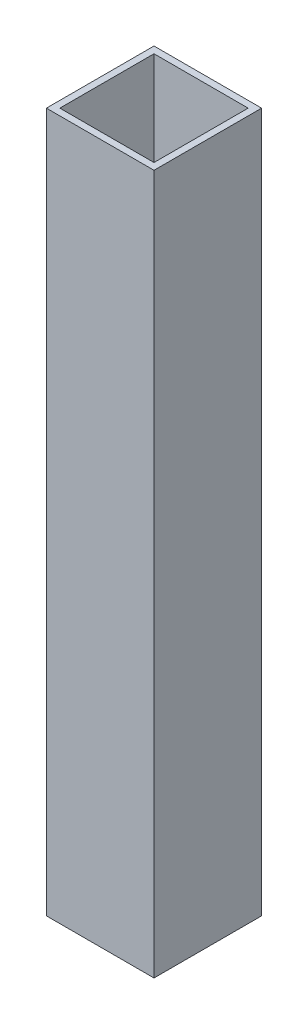
ISO-10303-21;
HEADER;
FILE_DESCRIPTION(('STEP AP214'),'2;1');
FILE_NAME('part.step','',(''),(''),'','','');
FILE_SCHEMA(('AUTOMOTIVE_DESIGN { 1 0 10303 214 1 1 1 1 }'));
ENDSEC;
DATA;
#1=APPLICATION_CONTEXT('core data for automotive mechanical design processes');
#2=APPLICATION_PROTOCOL_DEFINITION('international standard','automotive_design',2000,#1);
#3=PRODUCT_CONTEXT('',#1,'mechanical');
#4=PRODUCT('Part','Part','',(#3));
#5=PRODUCT_RELATED_PRODUCT_CATEGORY('part','',(#4));
#6=PRODUCT_DEFINITION_FORMATION('','',#4);
#7=PRODUCT_DEFINITION_CONTEXT('part definition',#1,'design');
#8=PRODUCT_DEFINITION('design','',#6,#7);
#9=PRODUCT_DEFINITION_SHAPE('','',#8);
#10=(LENGTH_UNIT() NAMED_UNIT(*) SI_UNIT(.MILLI.,.METRE.));
#11=(NAMED_UNIT(*) PLANE_ANGLE_UNIT() SI_UNIT($,.RADIAN.));
#12=(NAMED_UNIT(*) SI_UNIT($,.STERADIAN.) SOLID_ANGLE_UNIT());
#13=UNCERTAINTY_MEASURE_WITH_UNIT(LENGTH_MEASURE(1.E-05),#10,'distance_accuracy_value','');
#14=(GEOMETRIC_REPRESENTATION_CONTEXT(3) GLOBAL_UNCERTAINTY_ASSIGNED_CONTEXT((#13)) GLOBAL_UNIT_ASSIGNED_CONTEXT((#10,
#11,#12)) REPRESENTATION_CONTEXT('',''));
#15=CARTESIAN_POINT('',(0.,0.,0.));
#16=DIRECTION('',(0.,0.,1.));
#17=DIRECTION('',(1.,0.,0.));
#18=AXIS2_PLACEMENT_3D('',#15,#16,#17);
#19=CARTESIAN_POINT('',(821.935699023182,165.1,152.4));
#20=DIRECTION('',(1.,0.,0.));
#21=DIRECTION('',(0.,0.,-1.));
#22=AXIS2_PLACEMENT_3D('',#19,#20,#21);
#23=PLANE('',#22);
#24=DIRECTION('',(0.,0.,1.));
#25=VECTOR('',#24,1.);
#26=CARTESIAN_POINT('',(821.935699023182,-165.1,152.4));
#27=LINE('',#26,#25);
#28=CARTESIAN_POINT('',(821.935699023182,-165.1,130.175));
#29=VERTEX_POINT('',#28);
#30=CARTESIAN_POINT('',(821.935699023182,-165.1,174.625));
#31=VERTEX_POINT('',#30);
#32=EDGE_CURVE('E157',#29,#31,#27,.T.);
#33=ORIENTED_EDGE('',*,*,#32,.T.);
#34=DIRECTION('',(0.,-1.,0.));
#35=VECTOR('',#34,1.);
#36=CARTESIAN_POINT('',(821.935699023182,165.1,174.625));
#37=LINE('',#36,#35);
#38=CARTESIAN_POINT('',(821.935699023182,165.1,174.625));
#39=VERTEX_POINT('',#38);
#40=EDGE_CURVE('E9',#39,#31,#37,.T.);
#41=ORIENTED_EDGE('',*,*,#40,.F.);
#42=DIRECTION('',(0.,0.,1.));
#43=VECTOR('',#42,1.);
#44=CARTESIAN_POINT('',(821.935699023182,165.1,152.4));
#45=LINE('',#44,#43);
#46=CARTESIAN_POINT('',(821.935699023182,165.1,130.175));
#47=VERTEX_POINT('',#46);
#48=EDGE_CURVE('E117',#47,#39,#45,.T.);
#49=ORIENTED_EDGE('',*,*,#48,.F.);
#50=DIRECTION('',(0.,-1.,0.));
#51=VECTOR('',#50,1.);
#52=CARTESIAN_POINT('',(821.935699023182,165.1,130.175));
#53=LINE('',#52,#51);
#54=EDGE_CURVE('E39',#47,#29,#53,.T.);
#55=ORIENTED_EDGE('',*,*,#54,.T.);
#56=EDGE_LOOP('',(#33,#41,#49,#55));
#57=FACE_BOUND('',#56,.T.);
#58=ADVANCED_FACE('F14',(#57),#23,.F.);
#59=CARTESIAN_POINT('',(822.268575429916,165.1,174.625));
#60=DIRECTION('',(0.,0.,1.));
#61=DIRECTION('',(1.,0.,0.));
#62=AXIS2_PLACEMENT_3D('',#59,#60,#61);
#63=PLANE('',#62);
#64=DIRECTION('',(-1.,0.,0.));
#65=VECTOR('',#64,1.);
#66=CARTESIAN_POINT('',(822.268575429916,-165.1,174.625));
#67=LINE('',#66,#65);
#68=CARTESIAN_POINT('',(777.485699023182,-165.1,174.625));
#69=VERTEX_POINT('',#68);
#70=EDGE_CURVE('E124',#31,#69,#67,.T.);
#71=ORIENTED_EDGE('',*,*,#70,.T.);
#72=DIRECTION('',(0.,-1.,0.));
#73=VECTOR('',#72,1.);
#74=CARTESIAN_POINT('',(777.485699023182,165.1,174.625));
#75=LINE('',#74,#73);
#76=CARTESIAN_POINT('',(777.485699023182,165.1,174.625));
#77=VERTEX_POINT('',#76);
#78=EDGE_CURVE('E25',#77,#69,#75,.T.);
#79=ORIENTED_EDGE('',*,*,#78,.F.);
#80=DIRECTION('',(-1.,0.,0.));
#81=VECTOR('',#80,1.);
#82=CARTESIAN_POINT('',(822.268575429916,165.1,174.625));
#83=LINE('',#82,#81);
#84=EDGE_CURVE('E111',#39,#77,#83,.T.);
#85=ORIENTED_EDGE('',*,*,#84,.F.);
#86=ORIENTED_EDGE('',*,*,#40,.T.);
#87=EDGE_LOOP('',(#71,#79,#85,#86));
#88=FACE_BOUND('',#87,.T.);
#89=ADVANCED_FACE('F123',(#88),#63,.F.);
#90=CARTESIAN_POINT('',(777.485699023182,165.1,152.4));
#91=DIRECTION('',(1.,0.,0.));
#92=DIRECTION('',(0.,0.,-1.));
#93=AXIS2_PLACEMENT_3D('',#90,#91,#92);
#94=PLANE('',#93);
#95=DIRECTION('',(0.,0.,1.));
#96=VECTOR('',#95,1.);
#97=CARTESIAN_POINT('',(777.485699023182,-165.1,152.4));
#98=LINE('',#97,#96);
#99=CARTESIAN_POINT('',(777.485699023182,-165.1,130.175));
#100=VERTEX_POINT('',#99);
#101=EDGE_CURVE('E161',#100,#69,#98,.T.);
#102=ORIENTED_EDGE('',*,*,#101,.F.);
#103=DIRECTION('',(0.,-1.,0.));
#104=VECTOR('',#103,1.);
#105=CARTESIAN_POINT('',(777.485699023182,165.1,130.175));
#106=LINE('',#105,#104);
#107=CARTESIAN_POINT('',(777.485699023182,165.1,130.175));
#108=VERTEX_POINT('',#107);
#109=EDGE_CURVE('E74',#108,#100,#106,.T.);
#110=ORIENTED_EDGE('',*,*,#109,.F.);
#111=DIRECTION('',(0.,0.,1.));
#112=VECTOR('',#111,1.);
#113=CARTESIAN_POINT('',(777.485699023182,165.1,152.4));
#114=LINE('',#113,#112);
#115=EDGE_CURVE('E116',#108,#77,#114,.T.);
#116=ORIENTED_EDGE('',*,*,#115,.T.);
#117=ORIENTED_EDGE('',*,*,#78,.T.);
#118=EDGE_LOOP('',(#102,#110,#116,#117));
#119=FACE_BOUND('',#118,.T.);
#120=ADVANCED_FACE('F129',(#119),#94,.T.);
#121=CARTESIAN_POINT('',(661.181740408425,165.1,127.));
#122=DIRECTION('',(0.,0.,-1.));
#123=DIRECTION('',(-1.,0.,0.));
#124=AXIS2_PLACEMENT_3D('',#121,#122,#123);
#125=PLANE('',#124);
#126=DIRECTION('',(1.,0.,0.));
#127=VECTOR('',#126,1.);
#128=CARTESIAN_POINT('',(661.181740408425,-165.1,127.));
#129=LINE('',#128,#127);
#130=CARTESIAN_POINT('',(774.310699023182,-165.1,127.));
#131=VERTEX_POINT('',#130);
#132=CARTESIAN_POINT('',(825.110699023182,-165.1,127.));
#133=VERTEX_POINT('',#132);
#134=EDGE_CURVE('E141',#131,#133,#129,.T.);
#135=ORIENTED_EDGE('',*,*,#134,.F.);
#136=DIRECTION('',(0.,-1.,0.));
#137=VECTOR('',#136,1.);
#138=CARTESIAN_POINT('',(774.310699023182,165.1,127.));
#139=LINE('',#138,#137);
#140=CARTESIAN_POINT('',(774.310699023182,165.1,127.));
#141=VERTEX_POINT('',#140);
#142=EDGE_CURVE('E18',#141,#131,#139,.T.);
#143=ORIENTED_EDGE('',*,*,#142,.F.);
#144=DIRECTION('',(1.,0.,0.));
#145=VECTOR('',#144,1.);
#146=CARTESIAN_POINT('',(661.181740408425,165.1,127.));
#147=LINE('',#146,#145);
#148=CARTESIAN_POINT('',(825.110699023182,165.1,127.));
#149=VERTEX_POINT('',#148);
#150=EDGE_CURVE('E167',#141,#149,#147,.T.);
#151=ORIENTED_EDGE('',*,*,#150,.T.);
#152=DIRECTION('',(0.,-1.,0.));
#153=VECTOR('',#152,1.);
#154=CARTESIAN_POINT('',(825.110699023182,165.1,127.));
#155=LINE('',#154,#153);
#156=EDGE_CURVE('E137',#149,#133,#155,.T.);
#157=ORIENTED_EDGE('',*,*,#156,.T.);
#158=EDGE_LOOP('',(#135,#143,#151,#157));
#159=FACE_BOUND('',#158,.T.);
#160=ADVANCED_FACE('F16',(#159),#125,.T.);
#161=CARTESIAN_POINT('',(774.310699023182,165.1,152.4));
#162=DIRECTION('',(1.,0.,0.));
#163=DIRECTION('',(0.,0.,-1.));
#164=AXIS2_PLACEMENT_3D('',#161,#162,#163);
#165=PLANE('',#164);
#166=DIRECTION('',(0.,0.,1.));
#167=VECTOR('',#166,1.);
#168=CARTESIAN_POINT('',(774.310699023182,-165.1,152.4));
#169=LINE('',#168,#167);
#170=CARTESIAN_POINT('',(774.310699023182,-165.1,177.8));
#171=VERTEX_POINT('',#170);
#172=EDGE_CURVE('E145',#131,#171,#169,.T.);
#173=ORIENTED_EDGE('',*,*,#172,.T.);
#174=DIRECTION('',(0.,-1.,0.));
#175=VECTOR('',#174,1.);
#176=CARTESIAN_POINT('',(774.310699023182,165.1,177.8));
#177=LINE('',#176,#175);
#178=CARTESIAN_POINT('',(774.310699023182,165.1,177.8));
#179=VERTEX_POINT('',#178);
#180=EDGE_CURVE('E176',#179,#171,#177,.T.);
#181=ORIENTED_EDGE('',*,*,#180,.F.);
#182=DIRECTION('',(0.,0.,1.));
#183=VECTOR('',#182,1.);
#184=CARTESIAN_POINT('',(774.310699023182,165.1,152.4));
#185=LINE('',#184,#183);
#186=EDGE_CURVE('E187',#141,#179,#185,.T.);
#187=ORIENTED_EDGE('',*,*,#186,.F.);
#188=ORIENTED_EDGE('',*,*,#142,.T.);
#189=EDGE_LOOP('',(#173,#181,#187,#188));
#190=FACE_BOUND('',#189,.T.);
#191=ADVANCED_FACE('F186',(#190),#165,.F.);
#192=CARTESIAN_POINT('',(686.616627278044,165.1,177.8));
#193=DIRECTION('',(0.,0.,1.));
#194=DIRECTION('',(1.,0.,0.));
#195=AXIS2_PLACEMENT_3D('',#192,#193,#194);
#196=PLANE('',#195);
#197=DIRECTION('',(-1.,0.,0.));
#198=VECTOR('',#197,1.);
#199=CARTESIAN_POINT('',(686.616627278044,-165.1,177.8));
#200=LINE('',#199,#198);
#201=CARTESIAN_POINT('',(825.110699023182,-165.1,177.8));
#202=VERTEX_POINT('',#201);
#203=EDGE_CURVE('E149',#202,#171,#200,.T.);
#204=ORIENTED_EDGE('',*,*,#203,.F.);
#205=DIRECTION('',(0.,-1.,0.));
#206=VECTOR('',#205,1.);
#207=CARTESIAN_POINT('',(825.110699023182,165.1,177.8));
#208=LINE('',#207,#206);
#209=CARTESIAN_POINT('',(825.110699023182,165.1,177.8));
#210=VERTEX_POINT('',#209);
#211=EDGE_CURVE('E174',#210,#202,#208,.T.);
#212=ORIENTED_EDGE('',*,*,#211,.F.);
#213=DIRECTION('',(-1.,0.,0.));
#214=VECTOR('',#213,1.);
#215=CARTESIAN_POINT('',(686.616627278044,165.1,177.8));
#216=LINE('',#215,#214);
#217=EDGE_CURVE('E230',#210,#179,#216,.T.);
#218=ORIENTED_EDGE('',*,*,#217,.T.);
#219=ORIENTED_EDGE('',*,*,#180,.T.);
#220=EDGE_LOOP('',(#204,#212,#218,#219));
#221=FACE_BOUND('',#220,.T.);
#222=ADVANCED_FACE('F199',(#221),#196,.T.);
#223=CARTESIAN_POINT('',(825.110699023182,165.1,152.4));
#224=DIRECTION('',(1.,0.,0.));
#225=DIRECTION('',(0.,0.,-1.));
#226=AXIS2_PLACEMENT_3D('',#223,#224,#225);
#227=PLANE('',#226);
#228=DIRECTION('',(0.,0.,1.));
#229=VECTOR('',#228,1.);
#230=CARTESIAN_POINT('',(825.110699023182,-165.1,152.4));
#231=LINE('',#230,#229);
#232=EDGE_CURVE('E153',#133,#202,#231,.T.);
#233=ORIENTED_EDGE('',*,*,#232,.F.);
#234=ORIENTED_EDGE('',*,*,#156,.F.);
#235=DIRECTION('',(0.,0.,1.));
#236=VECTOR('',#235,1.);
#237=CARTESIAN_POINT('',(825.110699023182,165.1,152.4));
#238=LINE('',#237,#236);
#239=EDGE_CURVE('E197',#149,#210,#238,.T.);
#240=ORIENTED_EDGE('',*,*,#239,.T.);
#241=ORIENTED_EDGE('',*,*,#211,.T.);
#242=EDGE_LOOP('',(#233,#234,#240,#241));
#243=FACE_BOUND('',#242,.T.);
#244=ADVANCED_FACE('F196',(#243),#227,.T.);
#245=CARTESIAN_POINT('',(822.268575429916,165.1,130.175));
#246=DIRECTION('',(0.,0.,1.));
#247=DIRECTION('',(1.,0.,0.));
#248=AXIS2_PLACEMENT_3D('',#245,#246,#247);
#249=PLANE('',#248);
#250=DIRECTION('',(-1.,0.,0.));
#251=VECTOR('',#250,1.);
#252=CARTESIAN_POINT('',(822.268575429916,-165.1,130.175));
#253=LINE('',#252,#251);
#254=EDGE_CURVE('E163',#29,#100,#253,.T.);
#255=ORIENTED_EDGE('',*,*,#254,.F.);
#256=ORIENTED_EDGE('',*,*,#54,.F.);
#257=DIRECTION('',(-1.,0.,0.));
#258=VECTOR('',#257,1.);
#259=CARTESIAN_POINT('',(822.268575429916,165.1,130.175));
#260=LINE('',#259,#258);
#261=EDGE_CURVE('E131',#47,#108,#260,.T.);
#262=ORIENTED_EDGE('',*,*,#261,.T.);
#263=ORIENTED_EDGE('',*,*,#109,.T.);
#264=EDGE_LOOP('',(#255,#256,#262,#263));
#265=FACE_BOUND('',#264,.T.);
#266=ADVANCED_FACE('F207',(#265),#249,.T.);
#267=CARTESIAN_POINT('',(801.885855165659,165.1,152.4));
#268=DIRECTION('',(0.,1.,0.));
#269=DIRECTION('',(-1.,0.,0.));
#270=AXIS2_PLACEMENT_3D('',#267,#268,#269);
#271=PLANE('',#270);
#272=ORIENTED_EDGE('',*,*,#150,.F.);
#273=ORIENTED_EDGE('',*,*,#186,.T.);
#274=ORIENTED_EDGE('',*,*,#217,.F.);
#275=ORIENTED_EDGE('',*,*,#239,.F.);
#276=EDGE_LOOP('',(#272,#273,#274,#275));
#277=FACE_BOUND('',#276,.T.);
#278=ORIENTED_EDGE('',*,*,#48,.T.);
#279=ORIENTED_EDGE('',*,*,#84,.T.);
#280=ORIENTED_EDGE('',*,*,#115,.F.);
#281=ORIENTED_EDGE('',*,*,#261,.F.);
#282=EDGE_LOOP('',(#278,#279,#280,#281));
#283=FACE_BOUND('',#282,.T.);
#284=ADVANCED_FACE('F113',(#277,#283),#271,.T.);
#285=CARTESIAN_POINT('',(801.885855165659,-165.1,152.4));
#286=DIRECTION('',(0.,1.,0.));
#287=DIRECTION('',(-1.,0.,0.));
#288=AXIS2_PLACEMENT_3D('',#285,#286,#287);
#289=PLANE('',#288);
#290=ORIENTED_EDGE('',*,*,#134,.T.);
#291=ORIENTED_EDGE('',*,*,#232,.T.);
#292=ORIENTED_EDGE('',*,*,#203,.T.);
#293=ORIENTED_EDGE('',*,*,#172,.F.);
#294=EDGE_LOOP('',(#290,#291,#292,#293));
#295=FACE_BOUND('',#294,.T.);
#296=ORIENTED_EDGE('',*,*,#32,.F.);
#297=ORIENTED_EDGE('',*,*,#254,.T.);
#298=ORIENTED_EDGE('',*,*,#101,.T.);
#299=ORIENTED_EDGE('',*,*,#70,.F.);
#300=EDGE_LOOP('',(#296,#297,#298,#299));
#301=FACE_BOUND('',#300,.T.);
#302=ADVANCED_FACE('F190',(#295,#301),#289,.F.);
#303=CLOSED_SHELL('',(#58,#89,#120,#160,#191,#222,#244,#266,#284,#302));
#304=MANIFOLD_SOLID_BREP('B1',#303);
#305=ADVANCED_BREP_SHAPE_REPRESENTATION('',(#18,#304),#14);
#306=SHAPE_DEFINITION_REPRESENTATION(#9,#305);
ENDSEC;
END-ISO-10303-21;
